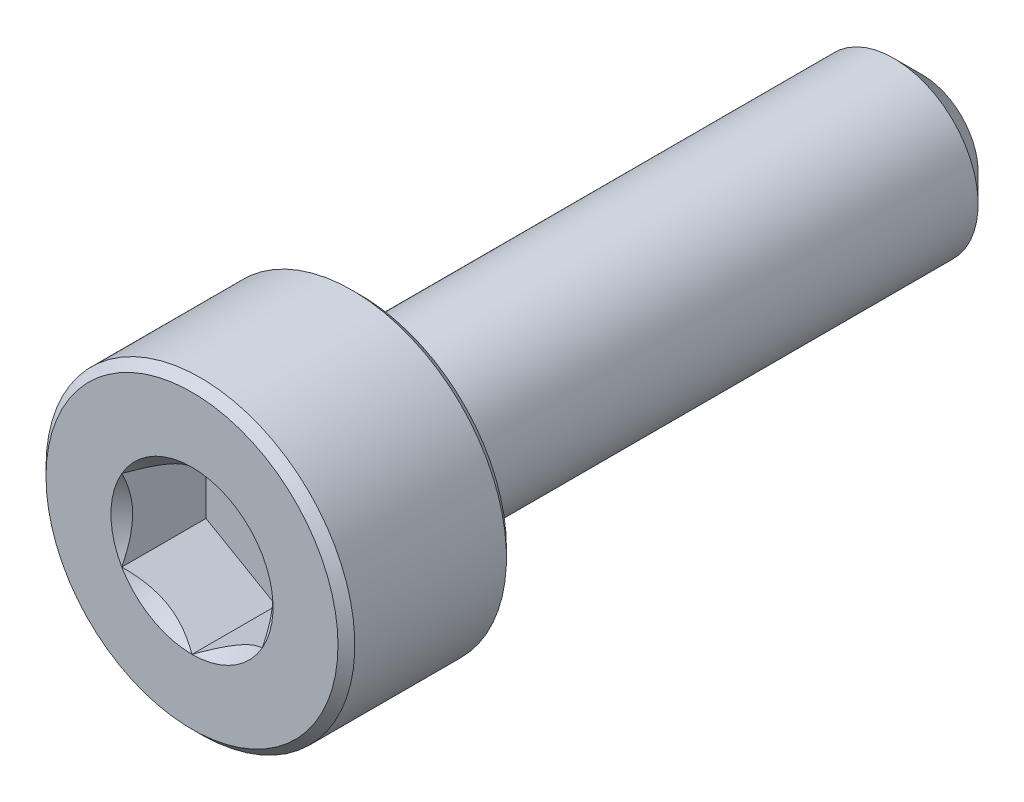
ISO-10303-21;
HEADER;
FILE_DESCRIPTION(('STEP AP214'),'2;1');
FILE_NAME('part.step','',(''),(''),'','','');
FILE_SCHEMA(('AUTOMOTIVE_DESIGN { 1 0 10303 214 1 1 1 1 }'));
ENDSEC;
DATA;
#1=APPLICATION_CONTEXT('core data for automotive mechanical design processes');
#2=APPLICATION_PROTOCOL_DEFINITION('international standard','automotive_design',2000,#1);
#3=PRODUCT_CONTEXT('',#1,'mechanical');
#4=PRODUCT('Part','Part','',(#3));
#5=PRODUCT_RELATED_PRODUCT_CATEGORY('part','',(#4));
#6=PRODUCT_DEFINITION_FORMATION('','',#4);
#7=PRODUCT_DEFINITION_CONTEXT('part definition',#1,'design');
#8=PRODUCT_DEFINITION('design','',#6,#7);
#9=PRODUCT_DEFINITION_SHAPE('','',#8);
#10=(LENGTH_UNIT() NAMED_UNIT(*) SI_UNIT(.MILLI.,.METRE.));
#11=(NAMED_UNIT(*) PLANE_ANGLE_UNIT() SI_UNIT($,.RADIAN.));
#12=(NAMED_UNIT(*) SI_UNIT($,.STERADIAN.) SOLID_ANGLE_UNIT());
#13=UNCERTAINTY_MEASURE_WITH_UNIT(LENGTH_MEASURE(1.E-05),#10,'distance_accuracy_value','');
#14=(GEOMETRIC_REPRESENTATION_CONTEXT(3) GLOBAL_UNCERTAINTY_ASSIGNED_CONTEXT((#13)) GLOBAL_UNIT_ASSIGNED_CONTEXT((#10,
#11,#12)) REPRESENTATION_CONTEXT('',''));
#15=CARTESIAN_POINT('',(0.,0.,0.));
#16=DIRECTION('',(0.,0.,1.));
#17=DIRECTION('',(1.,0.,0.));
#18=AXIS2_PLACEMENT_3D('',#15,#16,#17);
#19=CARTESIAN_POINT('',(0.,2.6,6.5));
#20=DIRECTION('',(0.,0.,1.));
#21=DIRECTION('',(1.,0.,0.));
#22=AXIS2_PLACEMENT_3D('',#19,#20,#21);
#23=PLANE('',#22);
#24=CARTESIAN_POINT('',(0.,0.,6.5));
#25=DIRECTION('',(0.,0.,1.));
#26=DIRECTION('',(1.,0.,0.));
#27=AXIS2_PLACEMENT_3D('',#24,#25,#26);
#28=CIRCLE('',#27,1.44337567297406);
#29=CARTESIAN_POINT('',(1.25,0.721687836487032,6.5));
#30=VERTEX_POINT('',#29);
#31=CARTESIAN_POINT('',(0.,1.44337567297406,6.5));
#32=VERTEX_POINT('',#31);
#33=EDGE_CURVE('E92',#30,#32,#28,.T.);
#34=ORIENTED_EDGE('',*,*,#33,.F.);
#35=CARTESIAN_POINT('',(1.25,-0.721687836487033,6.5));
#36=VERTEX_POINT('',#35);
#37=EDGE_CURVE('E52',#36,#30,#28,.T.);
#38=ORIENTED_EDGE('',*,*,#37,.F.);
#39=CARTESIAN_POINT('',(0.,-1.44337567297406,6.5));
#40=VERTEX_POINT('',#39);
#41=EDGE_CURVE('E278',#40,#36,#28,.T.);
#42=ORIENTED_EDGE('',*,*,#41,.F.);
#43=CARTESIAN_POINT('',(-1.25,-0.72168783648703,6.5));
#44=VERTEX_POINT('',#43);
#45=EDGE_CURVE('E59',#44,#40,#28,.T.);
#46=ORIENTED_EDGE('',*,*,#45,.F.);
#47=CARTESIAN_POINT('',(-1.25,0.721687836487034,6.5));
#48=VERTEX_POINT('',#47);
#49=EDGE_CURVE('E128',#48,#44,#28,.T.);
#50=ORIENTED_EDGE('',*,*,#49,.F.);
#51=EDGE_CURVE('E101',#32,#48,#28,.T.);
#52=ORIENTED_EDGE('',*,*,#51,.F.);
#53=EDGE_LOOP('',(#34,#38,#42,#46,#50,#52));
#54=FACE_BOUND('',#53,.T.);
#55=CARTESIAN_POINT('',(0.,0.,6.5));
#56=DIRECTION('',(0.,0.,-1.));
#57=DIRECTION('',(-1.,0.,0.));
#58=AXIS2_PLACEMENT_3D('',#55,#56,#57);
#59=CIRCLE('',#58,2.6);
#60=CARTESIAN_POINT('',(-2.6,0.,6.5));
#61=VERTEX_POINT('',#60);
#62=EDGE_CURVE('E46',#61,#61,#59,.T.);
#63=ORIENTED_EDGE('',*,*,#62,.F.);
#64=EDGE_LOOP('',(#63));
#65=FACE_BOUND('',#64,.T.);
#66=ADVANCED_FACE('F33',(#54,#65),#23,.T.);
#67=CARTESIAN_POINT('',(0.,0.,6.35));
#68=DIRECTION('',(0.,0.,-1.));
#69=DIRECTION('',(-1.,0.,0.));
#70=AXIS2_PLACEMENT_3D('',#67,#68,#69);
#71=CONICAL_SURFACE('',#70,2.75,0.785398163397443);
#72=ORIENTED_EDGE('',*,*,#62,.T.);
#73=EDGE_LOOP('',(#72));
#74=FACE_BOUND('',#73,.T.);
#75=CARTESIAN_POINT('',(0.,0.,6.35));
#76=DIRECTION('',(0.,0.,-1.));
#77=DIRECTION('',(-1.,0.,0.));
#78=AXIS2_PLACEMENT_3D('',#75,#76,#77);
#79=CIRCLE('',#78,2.75);
#80=CARTESIAN_POINT('',(-2.75,0.,6.35));
#81=VERTEX_POINT('',#80);
#82=EDGE_CURVE('E212',#81,#81,#79,.T.);
#83=ORIENTED_EDGE('',*,*,#82,.F.);
#84=EDGE_LOOP('',(#83));
#85=FACE_BOUND('',#84,.T.);
#86=ADVANCED_FACE('F217',(#74,#85),#71,.T.);
#87=CARTESIAN_POINT('',(0.,0.,-6.5));
#88=DIRECTION('',(0.,0.,-1.));
#89=DIRECTION('',(-1.,0.,0.));
#90=AXIS2_PLACEMENT_3D('',#87,#88,#89);
#91=CYLINDRICAL_SURFACE('',#90,2.75);
#92=ORIENTED_EDGE('',*,*,#82,.T.);
#93=EDGE_LOOP('',(#92));
#94=FACE_BOUND('',#93,.T.);
#95=CARTESIAN_POINT('',(0.,0.,3.65));
#96=DIRECTION('',(0.,0.,-1.));
#97=DIRECTION('',(-1.,0.,0.));
#98=AXIS2_PLACEMENT_3D('',#95,#96,#97);
#99=CIRCLE('',#98,2.75);
#100=CARTESIAN_POINT('',(-2.75,0.,3.65));
#101=VERTEX_POINT('',#100);
#102=EDGE_CURVE('E209',#101,#101,#99,.T.);
#103=ORIENTED_EDGE('',*,*,#102,.F.);
#104=EDGE_LOOP('',(#103));
#105=FACE_BOUND('',#104,.T.);
#106=ADVANCED_FACE('F223',(#94,#105),#91,.T.);
#107=CARTESIAN_POINT('',(0.,0.,3.5));
#108=DIRECTION('',(0.,0.,1.));
#109=DIRECTION('',(1.,0.,0.));
#110=AXIS2_PLACEMENT_3D('',#107,#108,#109);
#111=CONICAL_SURFACE('',#110,2.6,0.785398163397447);
#112=ORIENTED_EDGE('',*,*,#102,.T.);
#113=EDGE_LOOP('',(#112));
#114=FACE_BOUND('',#113,.T.);
#115=CARTESIAN_POINT('',(0.,0.,3.5));
#116=DIRECTION('',(0.,0.,-1.));
#117=DIRECTION('',(-1.,0.,0.));
#118=AXIS2_PLACEMENT_3D('',#115,#116,#117);
#119=CIRCLE('',#118,2.6);
#120=CARTESIAN_POINT('',(-2.6,0.,3.5));
#121=VERTEX_POINT('',#120);
#122=EDGE_CURVE('E206',#121,#121,#119,.T.);
#123=ORIENTED_EDGE('',*,*,#122,.F.);
#124=EDGE_LOOP('',(#123));
#125=FACE_BOUND('',#124,.T.);
#126=ADVANCED_FACE('F227',(#114,#125),#111,.T.);
#127=CARTESIAN_POINT('',(0.,2.6,3.5));
#128=DIRECTION('',(0.,0.,-1.));
#129=DIRECTION('',(-1.,0.,0.));
#130=AXIS2_PLACEMENT_3D('',#127,#128,#129);
#131=PLANE('',#130);
#132=ORIENTED_EDGE('',*,*,#122,.T.);
#133=EDGE_LOOP('',(#132));
#134=FACE_BOUND('',#133,.T.);
#135=CARTESIAN_POINT('',(0.,0.,3.5));
#136=DIRECTION('',(0.,0.,-1.));
#137=DIRECTION('',(-1.,0.,0.));
#138=AXIS2_PLACEMENT_3D('',#135,#136,#137);
#139=CIRCLE('',#138,1.5);
#140=CARTESIAN_POINT('',(-1.5,0.,3.5));
#141=VERTEX_POINT('',#140);
#142=EDGE_CURVE('E203',#141,#141,#139,.T.);
#143=ORIENTED_EDGE('',*,*,#142,.F.);
#144=EDGE_LOOP('',(#143));
#145=FACE_BOUND('',#144,.T.);
#146=ADVANCED_FACE('F233',(#134,#145),#131,.T.);
#147=CARTESIAN_POINT('',(0.,0.,-6.5));
#148=DIRECTION('',(0.,0.,-1.));
#149=DIRECTION('',(-1.,0.,0.));
#150=AXIS2_PLACEMENT_3D('',#147,#148,#149);
#151=CYLINDRICAL_SURFACE('',#150,1.5);
#152=ORIENTED_EDGE('',*,*,#142,.T.);
#153=EDGE_LOOP('',(#152));
#154=FACE_BOUND('',#153,.T.);
#155=CARTESIAN_POINT('',(0.,0.,-6.));
#156=DIRECTION('',(0.,0.,-1.));
#157=DIRECTION('',(-1.,0.,0.));
#158=AXIS2_PLACEMENT_3D('',#155,#156,#157);
#159=CIRCLE('',#158,1.5);
#160=CARTESIAN_POINT('',(-1.5,0.,-6.));
#161=VERTEX_POINT('',#160);
#162=EDGE_CURVE('E200',#161,#161,#159,.T.);
#163=ORIENTED_EDGE('',*,*,#162,.F.);
#164=EDGE_LOOP('',(#163));
#165=FACE_BOUND('',#164,.T.);
#166=ADVANCED_FACE('F237',(#154,#165),#151,.T.);
#167=CARTESIAN_POINT('',(0.,0.,-6.5));
#168=DIRECTION('',(0.,0.,1.));
#169=DIRECTION('',(1.,0.,0.));
#170=AXIS2_PLACEMENT_3D('',#167,#168,#169);
#171=CONICAL_SURFACE('',#170,1.,0.785398163397445);
#172=ORIENTED_EDGE('',*,*,#162,.T.);
#173=EDGE_LOOP('',(#172));
#174=FACE_BOUND('',#173,.T.);
#175=CARTESIAN_POINT('',(0.,0.,-6.5));
#176=DIRECTION('',(0.,0.,-1.));
#177=DIRECTION('',(-1.,0.,0.));
#178=AXIS2_PLACEMENT_3D('',#175,#176,#177);
#179=CIRCLE('',#178,1.);
#180=CARTESIAN_POINT('',(-1.,0.,-6.5));
#181=VERTEX_POINT('',#180);
#182=EDGE_CURVE('E188',#181,#181,#179,.T.);
#183=ORIENTED_EDGE('',*,*,#182,.F.);
#184=EDGE_LOOP('',(#183));
#185=FACE_BOUND('',#184,.T.);
#186=ADVANCED_FACE('F240',(#174,#185),#171,.T.);
#187=CARTESIAN_POINT('',(0.,1.,-6.5));
#188=DIRECTION('',(0.,0.,-1.));
#189=DIRECTION('',(-1.,0.,0.));
#190=AXIS2_PLACEMENT_3D('',#187,#188,#189);
#191=PLANE('',#190);
#192=ORIENTED_EDGE('',*,*,#182,.T.);
#193=EDGE_LOOP('',(#192));
#194=FACE_BOUND('',#193,.T.);
#195=ADVANCED_FACE('F161',(#194),#191,.T.);
#196=CARTESIAN_POINT('',(0.,0.,6.5));
#197=DIRECTION('',(0.,0.,1.));
#198=DIRECTION('',(1.,0.,0.));
#199=AXIS2_PLACEMENT_3D('',#196,#197,#198);
#200=CONICAL_SURFACE('',#199,1.44337567297406,0.78539816339745);
#201=ORIENTED_EDGE('',*,*,#51,.T.);
#202=CARTESIAN_POINT('',(0.000199999999999744,1.4434911430279,6.50011548390914));
#203=CARTESIAN_POINT('',(-0.0427751670715871,1.41867941875065,6.47532166805511));
#204=CARTESIAN_POINT('',(-0.0864690047459485,1.39345276980743,6.45198373441869));
#205=CARTESIAN_POINT('',(-0.175565930841942,1.34201263554194,6.40925200408454));
#206=CARTESIAN_POINT('',(-0.220977498357065,1.31579425481276,6.38988199236042));
#207=CARTESIAN_POINT('',(-0.31254782093526,1.26292610442246,6.35670048341348));
#208=CARTESIAN_POINT('',(-0.358683240175886,1.23628980770471,6.34280555905266));
#209=CARTESIAN_POINT('',(-0.451970080407593,1.18243062538508,6.32139728216064));
#210=CARTESIAN_POINT('',(-0.49911864913638,1.15520938653761,6.31386794156679));
#211=CARTESIAN_POINT('',(-0.580373556887253,1.10829684367467,6.30707449805071));
#212=CARTESIAN_POINT('',(-0.614374876627941,1.08866617256958,6.30606855910435));
#213=CARTESIAN_POINT('',(-0.682317764432478,1.04943932800611,6.30776141491132));
#214=CARTESIAN_POINT('',(-0.716259317655658,1.02984316311599,6.31046102721554));
#215=CARTESIAN_POINT('',(-0.7838148564575,0.990839954603499,6.31940893031638));
#216=CARTESIAN_POINT('',(-0.817428507286775,0.971433104248771,6.32566052589971));
#217=CARTESIAN_POINT('',(-0.884094638217814,0.932943395609905,6.34137568141391));
#218=CARTESIAN_POINT('',(-0.917146871030296,0.9138606800983,6.35084062008746));
#219=CARTESIAN_POINT('',(-1.00179969160026,0.864986351354568,6.37893139068759));
#220=CARTESIAN_POINT('',(-1.05286649242964,0.835502920149076,6.3996701574522));
#221=CARTESIAN_POINT('',(-1.15300085411325,0.777690319475909,6.44638713467148));
#222=CARTESIAN_POINT('',(-1.20207431157827,0.749357745598417,6.47234829594677));
#223=CARTESIAN_POINT('',(-1.2502,0.721572366433195,6.50011548390914));
#224=B_SPLINE_CURVE_WITH_KNOTS('',3,(#202,#203,#204,#205,#206,#207,#208,#209,#210,#211,#212,
#213,#214,#215,#216,#217,#218,#219,#220,#221,#222,#223),.UNSPECIFIED.,.F.,.F.,(4,2,2,2,2,2,2,2,
2,2,4),(0.,0.166533409618304,0.334037607289762,0.498880396489699,0.663307919240275,
0.780963963458827,0.898645970148453,1.01643764860773,1.1342799317155,1.32148652032141,
1.50809158792574),.UNSPECIFIED.);
#225=EDGE_CURVE('E11',#32,#48,#224,.T.);
#226=ORIENTED_EDGE('',*,*,#225,.F.);
#227=EDGE_LOOP('',(#201,#226));
#228=FACE_BOUND('',#227,.T.);
#229=ADVANCED_FACE('F105',(#228),#200,.F.);
#230=ORIENTED_EDGE('',*,*,#49,.T.);
#231=CARTESIAN_POINT('',(-1.25,-1.38510182026142,6.92237003651893));
#232=CARTESIAN_POINT('',(-1.25,-1.35111986791654,6.89714624624165));
#233=CARTESIAN_POINT('',(-1.25,-1.31694282798165,6.87218595709871));
#234=CARTESIAN_POINT('',(-1.25,-1.24812142703777,6.82289946459782));
#235=CARTESIAN_POINT('',(-1.25,-1.21347694519278,6.79857343015524));
#236=CARTESIAN_POINT('',(-1.25,-1.10822083307585,6.72636172374247));
#237=CARTESIAN_POINT('',(-1.25,-1.03680313809814,6.67963105654718));
#238=CARTESIAN_POINT('',(-1.25,-0.887382774503049,6.58837288422405));
#239=CARTESIAN_POINT('',(-1.25,-0.809230860354648,6.54408680062095));
#240=CARTESIAN_POINT('',(-1.25,-0.649095969627881,6.46341771993847));
#241=CARTESIAN_POINT('',(-1.25,-0.567127025778808,6.42700818374294));
#242=CARTESIAN_POINT('',(-1.25,-0.443557329507033,6.38248253765294));
#243=CARTESIAN_POINT('',(-1.25,-0.403672751512107,6.36961750891589));
#244=CARTESIAN_POINT('',(-1.25,-0.322988211982144,6.34709732599784));
#245=CARTESIAN_POINT('',(-1.25,-0.282188183066515,6.33744240892579));
#246=CARTESIAN_POINT('',(-1.25,-0.200572985420666,6.32199119638416));
#247=CARTESIAN_POINT('',(-1.25,-0.159769911896366,6.31613197737595));
#248=CARTESIAN_POINT('',(-1.25,-0.0777868304089239,6.30837795446847));
#249=CARTESIAN_POINT('',(-1.25,-0.0366068784025135,6.30648257133365));
#250=CARTESIAN_POINT('',(-1.25,0.0444682995491154,6.30677812945619));
#251=CARTESIAN_POINT('',(-1.25,0.0843640378229438,6.30884503442731));
#252=CARTESIAN_POINT('',(-1.25,0.163790547253528,6.31668957022574));
#253=CARTESIAN_POINT('',(-1.25,0.203321243504861,6.3224679461945));
#254=CARTESIAN_POINT('',(-1.25,0.282393986569086,6.33752741684666));
#255=CARTESIAN_POINT('',(-1.25,0.321924894821446,6.34686615693867));
#256=CARTESIAN_POINT('',(-1.25,0.400129025325507,6.36856655334425));
#257=CARTESIAN_POINT('',(-1.25,0.438802336675167,6.380927894012));
#258=CARTESIAN_POINT('',(-1.25,0.563172796674043,6.42526147457396));
#259=CARTESIAN_POINT('',(-1.25,0.647028633361639,6.46238856081833));
#260=CARTESIAN_POINT('',(-1.25,0.810774511829944,6.54485212067595));
#261=CARTESIAN_POINT('',(-1.25,0.890648632035888,6.59021863392705));
#262=CARTESIAN_POINT('',(-1.25,1.04325497137231,6.68372167893417));
#263=CARTESIAN_POINT('',(-1.25,1.11614441495489,6.73160472191527));
#264=CARTESIAN_POINT('',(-1.25,1.22353402780521,6.80558839420389));
#265=CARTESIAN_POINT('',(-1.25,1.25886567990417,6.83050307314204));
#266=CARTESIAN_POINT('',(-1.25,1.32904842299966,6.88098117650382));
#267=CARTESIAN_POINT('',(-1.25,1.36389964210964,6.90654442260415));
#268=CARTESIAN_POINT('',(-1.25,1.39855118205095,6.93237628525925));
#269=B_SPLINE_CURVE_WITH_KNOTS('',3,(#231,#232,#233,#234,#235,#236,#237,#238,#239,#240,#241,
#242,#243,#244,#245,#246,#247,#248,#249,#250,#251,#252,#253,#254,#255,#256,#257,#258,#259,#260,
#261,#262,#263,#264,#265,#266,#267,#268),.UNSPECIFIED.,.F.,.F.,(4,2,2,2,2,2,2,2,2,2,2,2,2,2,2,2,
2,2,4),(0.,0.126957685892467,0.253948844888988,0.50986920827304,0.779115443569667,
1.04743984536898,1.17305649245659,1.29868241592515,1.42216852630225,1.5456365903859,
1.6653025991614,1.78499264045314,1.90670905612004,2.02841276654157,2.30272027119573,
2.57804870101488,2.83955156876987,2.96924486861395,3.09890288771825),.UNSPECIFIED.);
#270=EDGE_CURVE('E100',#48,#44,#269,.F.);
#271=ORIENTED_EDGE('',*,*,#270,.F.);
#272=EDGE_LOOP('',(#230,#271));
#273=FACE_BOUND('',#272,.T.);
#274=ADVANCED_FACE('F255',(#273),#200,.F.);
#275=ORIENTED_EDGE('',*,*,#45,.T.);
#276=CARTESIAN_POINT('',(-1.2502,-0.721572366433195,6.50011548390914));
#277=CARTESIAN_POINT('',(-1.20722483292841,-0.746384090710444,6.47532166805511));
#278=CARTESIAN_POINT('',(-1.16353099525405,-0.771610739653665,6.45198373441869));
#279=CARTESIAN_POINT('',(-1.07443406915806,-0.823050873919155,6.40925200408454));
#280=CARTESIAN_POINT('',(-1.02902250164294,-0.849269254648334,6.38988199236042));
#281=CARTESIAN_POINT('',(-0.93745217906474,-0.902137405038636,6.35670048341348));
#282=CARTESIAN_POINT('',(-0.891316759824114,-0.928773701756388,6.34280555905266));
#283=CARTESIAN_POINT('',(-0.798029919592407,-0.982632884076013,6.32139728216064));
#284=CARTESIAN_POINT('',(-0.75088135086362,-1.00985412292348,6.31386794156679));
#285=CARTESIAN_POINT('',(-0.669626443112747,-1.05676666578643,6.30707449805071));
#286=CARTESIAN_POINT('',(-0.635625123372059,-1.07639733689152,6.30606855910435));
#287=CARTESIAN_POINT('',(-0.567682235567522,-1.11562418145499,6.30776141491132));
#288=CARTESIAN_POINT('',(-0.533740682344342,-1.1352203463451,6.31046102721554));
#289=CARTESIAN_POINT('',(-0.4661851435425,-1.1742235548576,6.31940893031638));
#290=CARTESIAN_POINT('',(-0.432571492713225,-1.19363040521233,6.32566052589971));
#291=CARTESIAN_POINT('',(-0.365905361782187,-1.23212011385119,6.34137568141391));
#292=CARTESIAN_POINT('',(-0.332853128969704,-1.2512028293628,6.35084062008746));
#293=CARTESIAN_POINT('',(-0.248200308399735,-1.30007715810653,6.37893139068759));
#294=CARTESIAN_POINT('',(-0.197133507570362,-1.32956058931202,6.3996701574522));
#295=CARTESIAN_POINT('',(-0.0969991458867457,-1.38737318998519,6.44638713467148));
#296=CARTESIAN_POINT('',(-0.047925688421731,-1.41570576386268,6.47234829594677));
#297=CARTESIAN_POINT('',(0.000199999999999764,-1.4434911430279,6.50011548390914));
#298=B_SPLINE_CURVE_WITH_KNOTS('',3,(#276,#277,#278,#279,#280,#281,#282,#283,#284,#285,#286,
#287,#288,#289,#290,#291,#292,#293,#294,#295,#296,#297),.UNSPECIFIED.,.F.,.F.,(4,2,2,2,2,2,2,2,
2,2,4),(0.,0.166533409618304,0.334037607289762,0.498880396489699,0.663307919240275,
0.780963963458827,0.898645970148454,1.01643764860773,1.1342799317155,1.32148652032141,
1.50809158792574),.UNSPECIFIED.);
#299=EDGE_CURVE('E137',#44,#40,#298,.T.);
#300=ORIENTED_EDGE('',*,*,#299,.F.);
#301=EDGE_LOOP('',(#275,#300));
#302=FACE_BOUND('',#301,.T.);
#303=ADVANCED_FACE('F259',(#302),#200,.F.);
#304=ORIENTED_EDGE('',*,*,#41,.T.);
#305=CARTESIAN_POINT('',(-0.000200000000000316,-1.4434911430279,6.50011548390914));
#306=CARTESIAN_POINT('',(0.0427751670715864,-1.41867941875065,6.47532166805511));
#307=CARTESIAN_POINT('',(0.0864690047459477,-1.39345276980743,6.45198373441869));
#308=CARTESIAN_POINT('',(0.175565930841942,-1.34201263554194,6.40925200408454));
#309=CARTESIAN_POINT('',(0.220977498357064,-1.31579425481276,6.38988199236042));
#310=CARTESIAN_POINT('',(0.31254782093526,-1.26292610442246,6.35670048341348));
#311=CARTESIAN_POINT('',(0.358683240175886,-1.23628980770471,6.34280555905266));
#312=CARTESIAN_POINT('',(0.451970080407592,-1.18243062538508,6.32139728216064));
#313=CARTESIAN_POINT('',(0.49911864913638,-1.15520938653761,6.31386794156679));
#314=CARTESIAN_POINT('',(0.580373556887252,-1.10829684367467,6.30707449805071));
#315=CARTESIAN_POINT('',(0.614374876627941,-1.08866617256958,6.30606855910435));
#316=CARTESIAN_POINT('',(0.682317764432477,-1.04943932800611,6.30776141491132));
#317=CARTESIAN_POINT('',(0.716259317655657,-1.02984316311599,6.31046102721554));
#318=CARTESIAN_POINT('',(0.783814856457499,-0.9908399546035,6.31940893031638));
#319=CARTESIAN_POINT('',(0.817428507286775,-0.971433104248771,6.32566052589971));
#320=CARTESIAN_POINT('',(0.884094638217813,-0.932943395609906,6.34137568141391));
#321=CARTESIAN_POINT('',(0.917146871030295,-0.913860680098301,6.35084062008746));
#322=CARTESIAN_POINT('',(1.00179969160026,-0.864986351354568,6.37893139068759));
#323=CARTESIAN_POINT('',(1.05286649242964,-0.835502920149076,6.3996701574522));
#324=CARTESIAN_POINT('',(1.15300085411325,-0.777690319475909,6.44638713467148));
#325=CARTESIAN_POINT('',(1.20207431157827,-0.749357745598418,6.47234829594677));
#326=CARTESIAN_POINT('',(1.2502,-0.721572366433196,6.50011548390914));
#327=B_SPLINE_CURVE_WITH_KNOTS('',3,(#305,#306,#307,#308,#309,#310,#311,#312,#313,#314,#315,
#316,#317,#318,#319,#320,#321,#322,#323,#324,#325,#326),.UNSPECIFIED.,.F.,.F.,(4,2,2,2,2,2,2,2,
2,2,4),(0.,0.166533409618304,0.334037607289762,0.498880396489698,0.663307919240274,
0.780963963458827,0.898645970148453,1.01643764860773,1.1342799317155,1.32148652032141,
1.50809158792573),.UNSPECIFIED.);
#328=EDGE_CURVE('E280',#40,#36,#327,.T.);
#329=ORIENTED_EDGE('',*,*,#328,.F.);
#330=EDGE_LOOP('',(#304,#329));
#331=FACE_BOUND('',#330,.T.);
#332=ADVANCED_FACE('F268',(#331),#200,.F.);
#333=ORIENTED_EDGE('',*,*,#37,.T.);
#334=CARTESIAN_POINT('',(1.25,-1.38510181874983,6.92237003539674));
#335=CARTESIAN_POINT('',(1.25,-1.3511198664462,6.89714624516244));
#336=CARTESIAN_POINT('',(1.25,-1.31694282655271,6.87218595606241));
#337=CARTESIAN_POINT('',(1.25,-1.24812142569208,6.82289946364711));
#338=CARTESIAN_POINT('',(1.25,-1.21347694388892,6.7985734292472));
#339=CARTESIAN_POINT('',(1.25,-1.10822083190007,6.72636172296323));
#340=CARTESIAN_POINT('',(1.25,-1.0368031370095,6.67963105585343));
#341=CARTESIAN_POINT('',(1.25,-0.887382773604424,6.58837288370571));
#342=CARTESIAN_POINT('',(1.25,-0.809230859559389,6.54408680019188));
#343=CARTESIAN_POINT('',(1.25,-0.649095969048194,6.46341771967474));
#344=CARTESIAN_POINT('',(1.25,-0.567127025311259,6.42700818355541));
#345=CARTESIAN_POINT('',(1.25,-0.443557329124526,6.38248253752399));
#346=CARTESIAN_POINT('',(1.25,-0.403672751095206,6.36961750878661));
#347=CARTESIAN_POINT('',(1.25,-0.322988211495524,6.34709732587494));
#348=CARTESIAN_POINT('',(1.25,-0.28218818254457,6.3374424088096));
#349=CARTESIAN_POINT('',(1.25,-0.200572984829335,6.32199119628927));
#350=CARTESIAN_POINT('',(1.25,-0.159769911270982,6.31613197729548));
#351=CARTESIAN_POINT('',(1.25,-0.0777868297167932,6.30837795442431));
#352=CARTESIAN_POINT('',(1.25,-0.0366068776776873,6.30648257131139));
#353=CARTESIAN_POINT('',(1.25,0.0444683003388063,6.30677812948321));
#354=CARTESIAN_POINT('',(1.25,0.0843640386448799,6.3088450344818));
#355=CARTESIAN_POINT('',(1.25,0.16379054813703,6.3166895703397));
#356=CARTESIAN_POINT('',(1.25,0.203321244417682,6.32246794634046));
#357=CARTESIAN_POINT('',(1.25,0.282393987539771,6.33752741705993));
#358=CARTESIAN_POINT('',(1.25,0.321924895820597,6.34686615718743));
#359=CARTESIAN_POINT('',(1.25,0.400129026379048,6.36856655366507));
#360=CARTESIAN_POINT('',(1.25,0.438802337754633,6.38092789436938));
#361=CARTESIAN_POINT('',(1.25,0.563172797994066,6.42526147510657));
#362=CARTESIAN_POINT('',(1.25,0.647028634884195,6.46238856151275));
#363=CARTESIAN_POINT('',(1.25,0.810774513742062,6.54485212171169));
#364=CARTESIAN_POINT('',(1.25,0.890648634134939,6.59021863514241));
#365=CARTESIAN_POINT('',(1.25,1.04325497380785,6.68372168049333));
#366=CARTESIAN_POINT('',(1.25,1.11614441754118,6.73160472363706));
#367=CARTESIAN_POINT('',(1.25,1.22353403061444,6.8055883961688));
#368=CARTESIAN_POINT('',(1.25,1.25886568278664,6.83050307518733));
#369=CARTESIAN_POINT('',(1.25,1.32904842602817,6.88098117870981));
#370=CARTESIAN_POINT('',(1.25,1.36389964521094,6.90654442489043));
#371=CARTESIAN_POINT('',(1.25,1.3985511852249,6.93237628762573));
#372=B_SPLINE_CURVE_WITH_KNOTS('',3,(#334,#335,#336,#337,#338,#339,#340,#341,#342,#343,#344,
#345,#346,#347,#348,#349,#350,#351,#352,#353,#354,#355,#356,#357,#358,#359,#360,#361,#362,#363,
#364,#365,#366,#367,#368,#369,#370,#371),.UNSPECIFIED.,.F.,.F.,(4,2,2,2,2,2,2,2,2,2,2,2,2,2,2,2,
2,2,4),(0.,0.126957685716233,0.253948844536467,0.509869207561397,0.779115442456378,
1.04743984385779,1.17305649104353,1.29868241461005,1.42216852508156,1.54563658925964,
1.66530259813563,1.78499263952808,1.9067090553025,2.02841276583151,2.30272027123448,
2.57804870180744,2.83955157020837,2.96924487037104,3.0989028897939),.UNSPECIFIED.);
#373=EDGE_CURVE('E117',#36,#30,#372,.T.);
#374=ORIENTED_EDGE('',*,*,#373,.F.);
#375=EDGE_LOOP('',(#333,#374));
#376=FACE_BOUND('',#375,.T.);
#377=ADVANCED_FACE('F262',(#376),#200,.F.);
#378=ORIENTED_EDGE('',*,*,#33,.T.);
#379=CARTESIAN_POINT('',(1.2502,0.721572366433195,6.50011548390914));
#380=CARTESIAN_POINT('',(1.20722483292841,0.746384090710444,6.47532166805511));
#381=CARTESIAN_POINT('',(1.16353099525405,0.771610739653665,6.45198373441869));
#382=CARTESIAN_POINT('',(1.07443406915806,0.823050873919155,6.40925200408454));
#383=CARTESIAN_POINT('',(1.02902250164294,0.849269254648333,6.38988199236042));
#384=CARTESIAN_POINT('',(0.93745217906474,0.902137405038636,6.35670048341348));
#385=CARTESIAN_POINT('',(0.891316759824114,0.928773701756387,6.34280555905266));
#386=CARTESIAN_POINT('',(0.798029919592407,0.982632884076013,6.32139728216064));
#387=CARTESIAN_POINT('',(0.75088135086362,1.00985412292348,6.31386794156679));
#388=CARTESIAN_POINT('',(0.669626443112747,1.05676666578643,6.30707449805071));
#389=CARTESIAN_POINT('',(0.635625123372059,1.07639733689152,6.30606855910435));
#390=CARTESIAN_POINT('',(0.567682235567522,1.11562418145499,6.30776141491132));
#391=CARTESIAN_POINT('',(0.533740682344342,1.1352203463451,6.31046102721554));
#392=CARTESIAN_POINT('',(0.4661851435425,1.1742235548576,6.31940893031638));
#393=CARTESIAN_POINT('',(0.432571492713225,1.19363040521233,6.32566052589971));
#394=CARTESIAN_POINT('',(0.365905361782187,1.23212011385119,6.34137568141391));
#395=CARTESIAN_POINT('',(0.332853128969704,1.2512028293628,6.35084062008746));
#396=CARTESIAN_POINT('',(0.248200308399736,1.30007715810653,6.37893139068759));
#397=CARTESIAN_POINT('',(0.197133507570362,1.32956058931202,6.3996701574522));
#398=CARTESIAN_POINT('',(0.0969991458867451,1.38737318998519,6.44638713467148));
#399=CARTESIAN_POINT('',(0.0479256884217304,1.41570576386268,6.47234829594677));
#400=CARTESIAN_POINT('',(-0.000200000000000211,1.4434911430279,6.50011548390914));
#401=B_SPLINE_CURVE_WITH_KNOTS('',3,(#379,#380,#381,#382,#383,#384,#385,#386,#387,#388,#389,
#390,#391,#392,#393,#394,#395,#396,#397,#398,#399,#400),.UNSPECIFIED.,.F.,.F.,(4,2,2,2,2,2,2,2,
2,2,4),(0.,0.166533409618303,0.334037607289761,0.498880396489698,0.663307919240274,
0.780963963458826,0.898645970148452,1.01643764860773,1.13427993171549,1.32148652032141,
1.50809158792573),.UNSPECIFIED.);
#402=EDGE_CURVE('E96',#30,#32,#401,.T.);
#403=ORIENTED_EDGE('',*,*,#402,.F.);
#404=EDGE_LOOP('',(#378,#403));
#405=FACE_BOUND('',#404,.T.);
#406=ADVANCED_FACE('F94',(#405),#200,.F.);
#407=CARTESIAN_POINT('',(0.,0.,5.));
#408=DIRECTION('',(0.,0.,1.));
#409=DIRECTION('',(1.,0.,0.));
#410=AXIS2_PLACEMENT_3D('',#407,#408,#409);
#411=PLANE('',#410);
#412=DIRECTION('',(-0.866025403784439,0.5,0.));
#413=VECTOR('',#412,1.);
#414=CARTESIAN_POINT('',(1.25,0.721687836487033,5.));
#415=LINE('',#414,#413);
#416=CARTESIAN_POINT('',(1.25,0.721687836487033,5.));
#417=VERTEX_POINT('',#416);
#418=CARTESIAN_POINT('',(0.,1.44337567297406,5.));
#419=VERTEX_POINT('',#418);
#420=EDGE_CURVE('E116',#417,#419,#415,.T.);
#421=ORIENTED_EDGE('',*,*,#420,.T.);
#422=DIRECTION('',(-0.866025403784439,-0.5,0.));
#423=VECTOR('',#422,1.);
#424=CARTESIAN_POINT('',(0.,1.44337567297406,5.));
#425=LINE('',#424,#423);
#426=CARTESIAN_POINT('',(-1.25,0.721687836487033,5.));
#427=VERTEX_POINT('',#426);
#428=EDGE_CURVE('E121',#419,#427,#425,.T.);
#429=ORIENTED_EDGE('',*,*,#428,.T.);
#430=DIRECTION('',(0.,-1.,0.));
#431=VECTOR('',#430,1.);
#432=CARTESIAN_POINT('',(-1.25,0.721687836487033,5.));
#433=LINE('',#432,#431);
#434=CARTESIAN_POINT('',(-1.25,-0.721687836487032,5.));
#435=VERTEX_POINT('',#434);
#436=EDGE_CURVE('E176',#427,#435,#433,.T.);
#437=ORIENTED_EDGE('',*,*,#436,.T.);
#438=DIRECTION('',(0.866025403784439,-0.5,0.));
#439=VECTOR('',#438,1.);
#440=CARTESIAN_POINT('',(-1.25,-0.721687836487032,5.));
#441=LINE('',#440,#439);
#442=CARTESIAN_POINT('',(0.,-1.44337567297406,5.));
#443=VERTEX_POINT('',#442);
#444=EDGE_CURVE('E179',#435,#443,#441,.T.);
#445=ORIENTED_EDGE('',*,*,#444,.T.);
#446=DIRECTION('',(0.866025403784439,0.5,0.));
#447=VECTOR('',#446,1.);
#448=CARTESIAN_POINT('',(0.,-1.44337567297406,5.));
#449=LINE('',#448,#447);
#450=CARTESIAN_POINT('',(1.25,-0.721687836487033,5.));
#451=VERTEX_POINT('',#450);
#452=EDGE_CURVE('E182',#443,#451,#449,.T.);
#453=ORIENTED_EDGE('',*,*,#452,.T.);
#454=DIRECTION('',(0.,1.,0.));
#455=VECTOR('',#454,1.);
#456=CARTESIAN_POINT('',(1.25,-0.721687836487033,5.));
#457=LINE('',#456,#455);
#458=EDGE_CURVE('E124',#451,#417,#457,.T.);
#459=ORIENTED_EDGE('',*,*,#458,.T.);
#460=EDGE_LOOP('',(#421,#429,#437,#445,#453,#459));
#461=FACE_BOUND('',#460,.T.);
#462=ADVANCED_FACE('F156',(#461),#411,.T.);
#463=CARTESIAN_POINT('',(0.,1.44337567297406,5.));
#464=DIRECTION('',(-0.5,0.866025403784439,0.));
#465=DIRECTION('',(-0.866025403784439,-0.5,0.));
#466=AXIS2_PLACEMENT_3D('',#463,#464,#465);
#467=PLANE('',#466);
#468=DIRECTION('',(0.,0.,1.));
#469=VECTOR('',#468,1.);
#470=CARTESIAN_POINT('',(0.,1.44337567297406,5.));
#471=LINE('',#470,#469);
#472=EDGE_CURVE('E113',#419,#32,#471,.T.);
#473=ORIENTED_EDGE('',*,*,#472,.T.);
#474=ORIENTED_EDGE('',*,*,#225,.T.);
#475=DIRECTION('',(0.,0.,1.));
#476=VECTOR('',#475,1.);
#477=CARTESIAN_POINT('',(-1.25,0.721687836487033,5.));
#478=LINE('',#477,#476);
#479=EDGE_CURVE('E123',#427,#48,#478,.T.);
#480=ORIENTED_EDGE('',*,*,#479,.F.);
#481=ORIENTED_EDGE('',*,*,#428,.F.);
#482=EDGE_LOOP('',(#473,#474,#480,#481));
#483=FACE_BOUND('',#482,.T.);
#484=ADVANCED_FACE('F119',(#483),#467,.F.);
#485=CARTESIAN_POINT('',(-1.25,0.721687836487033,5.));
#486=DIRECTION('',(-1.,0.,0.));
#487=DIRECTION('',(0.,-1.,0.));
#488=AXIS2_PLACEMENT_3D('',#485,#486,#487);
#489=PLANE('',#488);
#490=ORIENTED_EDGE('',*,*,#479,.T.);
#491=ORIENTED_EDGE('',*,*,#270,.T.);
#492=DIRECTION('',(0.,0.,1.));
#493=VECTOR('',#492,1.);
#494=CARTESIAN_POINT('',(-1.25,-0.721687836487032,5.));
#495=LINE('',#494,#493);
#496=EDGE_CURVE('E194',#435,#44,#495,.T.);
#497=ORIENTED_EDGE('',*,*,#496,.F.);
#498=ORIENTED_EDGE('',*,*,#436,.F.);
#499=EDGE_LOOP('',(#490,#491,#497,#498));
#500=FACE_BOUND('',#499,.T.);
#501=ADVANCED_FACE('F146',(#500),#489,.F.);
#502=CARTESIAN_POINT('',(-1.25,-0.721687836487032,5.));
#503=DIRECTION('',(-0.5,-0.866025403784439,0.));
#504=DIRECTION('',(0.866025403784439,-0.5,0.));
#505=AXIS2_PLACEMENT_3D('',#502,#503,#504);
#506=PLANE('',#505);
#507=ORIENTED_EDGE('',*,*,#496,.T.);
#508=ORIENTED_EDGE('',*,*,#299,.T.);
#509=DIRECTION('',(0.,0.,1.));
#510=VECTOR('',#509,1.);
#511=CARTESIAN_POINT('',(0.,-1.44337567297406,5.));
#512=LINE('',#511,#510);
#513=EDGE_CURVE('E191',#443,#40,#512,.T.);
#514=ORIENTED_EDGE('',*,*,#513,.F.);
#515=ORIENTED_EDGE('',*,*,#444,.F.);
#516=EDGE_LOOP('',(#507,#508,#514,#515));
#517=FACE_BOUND('',#516,.T.);
#518=ADVANCED_FACE('F149',(#517),#506,.F.);
#519=CARTESIAN_POINT('',(0.,-1.44337567297406,5.));
#520=DIRECTION('',(0.5,-0.866025403784439,0.));
#521=DIRECTION('',(0.866025403784439,0.5,0.));
#522=AXIS2_PLACEMENT_3D('',#519,#520,#521);
#523=PLANE('',#522);
#524=ORIENTED_EDGE('',*,*,#513,.T.);
#525=ORIENTED_EDGE('',*,*,#328,.T.);
#526=DIRECTION('',(0.,0.,1.));
#527=VECTOR('',#526,1.);
#528=CARTESIAN_POINT('',(1.25,-0.721687836487033,5.));
#529=LINE('',#528,#527);
#530=EDGE_CURVE('E189',#451,#36,#529,.T.);
#531=ORIENTED_EDGE('',*,*,#530,.F.);
#532=ORIENTED_EDGE('',*,*,#452,.F.);
#533=EDGE_LOOP('',(#524,#525,#531,#532));
#534=FACE_BOUND('',#533,.T.);
#535=ADVANCED_FACE('F286',(#534),#523,.F.);
#536=CARTESIAN_POINT('',(1.25,-0.721687836487033,5.));
#537=DIRECTION('',(1.,0.,0.));
#538=DIRECTION('',(0.,1.,0.));
#539=AXIS2_PLACEMENT_3D('',#536,#537,#538);
#540=PLANE('',#539);
#541=ORIENTED_EDGE('',*,*,#530,.T.);
#542=ORIENTED_EDGE('',*,*,#373,.T.);
#543=DIRECTION('',(0.,0.,1.));
#544=VECTOR('',#543,1.);
#545=CARTESIAN_POINT('',(1.25,0.721687836487033,5.));
#546=LINE('',#545,#544);
#547=EDGE_CURVE('E115',#417,#30,#546,.T.);
#548=ORIENTED_EDGE('',*,*,#547,.F.);
#549=ORIENTED_EDGE('',*,*,#458,.F.);
#550=EDGE_LOOP('',(#541,#542,#548,#549));
#551=FACE_BOUND('',#550,.T.);
#552=ADVANCED_FACE('F160',(#551),#540,.F.);
#553=CARTESIAN_POINT('',(1.25,0.721687836487033,5.));
#554=DIRECTION('',(0.5,0.866025403784439,0.));
#555=DIRECTION('',(-0.866025403784439,0.5,0.));
#556=AXIS2_PLACEMENT_3D('',#553,#554,#555);
#557=PLANE('',#556);
#558=ORIENTED_EDGE('',*,*,#547,.T.);
#559=ORIENTED_EDGE('',*,*,#402,.T.);
#560=ORIENTED_EDGE('',*,*,#472,.F.);
#561=ORIENTED_EDGE('',*,*,#420,.F.);
#562=EDGE_LOOP('',(#558,#559,#560,#561));
#563=FACE_BOUND('',#562,.T.);
#564=ADVANCED_FACE('F111',(#563),#557,.F.);
#565=CLOSED_SHELL('',(#66,#86,#106,#126,#146,#166,#186,#195,#229,#274,#303,#332,#377,#406,#462,
#484,#501,#518,#535,#552,#564));
#566=MANIFOLD_SOLID_BREP('B2',#565);
#567=ADVANCED_BREP_SHAPE_REPRESENTATION('',(#18,#566),#14);
#568=SHAPE_DEFINITION_REPRESENTATION(#9,#567);
ENDSEC;
END-ISO-10303-21;
